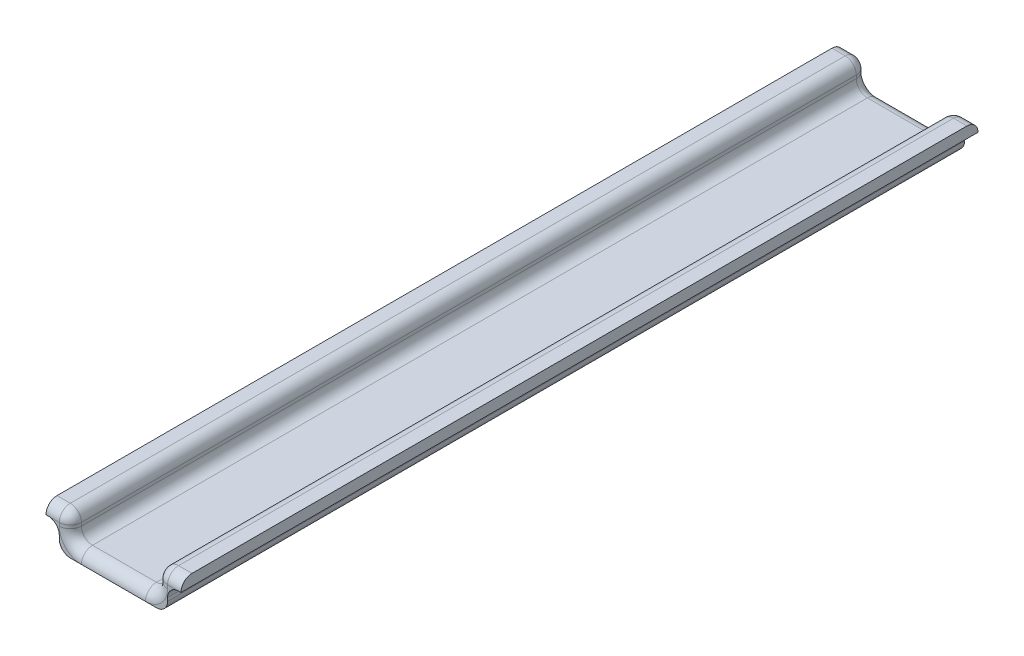
ISO-10303-21;
HEADER;
FILE_DESCRIPTION(('STEP AP214'),'2;1');
FILE_NAME('part.step','',(''),(''),'','','');
FILE_SCHEMA(('AUTOMOTIVE_DESIGN { 1 0 10303 214 1 1 1 1 }'));
ENDSEC;
DATA;
#1=APPLICATION_CONTEXT('core data for automotive mechanical design processes');
#2=APPLICATION_PROTOCOL_DEFINITION('international standard','automotive_design',2000,#1);
#3=PRODUCT_CONTEXT('',#1,'mechanical');
#4=PRODUCT('Part','Part','',(#3));
#5=PRODUCT_RELATED_PRODUCT_CATEGORY('part','',(#4));
#6=PRODUCT_DEFINITION_FORMATION('','',#4);
#7=PRODUCT_DEFINITION_CONTEXT('part definition',#1,'design');
#8=PRODUCT_DEFINITION('design','',#6,#7);
#9=PRODUCT_DEFINITION_SHAPE('','',#8);
#10=(LENGTH_UNIT() NAMED_UNIT(*) SI_UNIT(.MILLI.,.METRE.));
#11=(NAMED_UNIT(*) PLANE_ANGLE_UNIT() SI_UNIT($,.RADIAN.));
#12=(NAMED_UNIT(*) SI_UNIT($,.STERADIAN.) SOLID_ANGLE_UNIT());
#13=UNCERTAINTY_MEASURE_WITH_UNIT(LENGTH_MEASURE(1.E-05),#10,'distance_accuracy_value','');
#14=(GEOMETRIC_REPRESENTATION_CONTEXT(3) GLOBAL_UNCERTAINTY_ASSIGNED_CONTEXT((#13)) GLOBAL_UNIT_ASSIGNED_CONTEXT((#10,
#11,#12)) REPRESENTATION_CONTEXT('',''));
#15=CARTESIAN_POINT('',(0.,0.,0.));
#16=DIRECTION('',(0.,0.,1.));
#17=DIRECTION('',(1.,0.,0.));
#18=AXIS2_PLACEMENT_3D('',#15,#16,#17);
#19=CARTESIAN_POINT('',(-11.7684748149153,3.27703373913075,-2.54));
#20=DIRECTION('',(0.,0.,-1.));
#21=DIRECTION('',(-1.,0.,0.));
#22=AXIS2_PLACEMENT_3D('',#19,#20,#21);
#23=CYLINDRICAL_SURFACE('',#22,2.54);
#24=DIRECTION('',(0.,0.,1.));
#25=VECTOR('',#24,1.);
#26=CARTESIAN_POINT('',(-11.7684748149153,5.81703373913075,-2.54));
#27=LINE('',#26,#25);
#28=CARTESIAN_POINT('',(-11.7684748149153,5.81703373913075,-2.54));
#29=VERTEX_POINT('',#28);
#30=CARTESIAN_POINT('',(-11.7684748149153,5.81703373913075,180.34));
#31=VERTEX_POINT('',#30);
#32=EDGE_CURVE('E210',#29,#31,#27,.T.);
#33=ORIENTED_EDGE('',*,*,#32,.F.);
#34=CARTESIAN_POINT('',(-11.7684748149153,3.27703373913075,-2.54));
#35=DIRECTION('',(0.,0.,-1.));
#36=DIRECTION('',(-1.,0.,0.));
#37=AXIS2_PLACEMENT_3D('',#34,#35,#36);
#38=CIRCLE('',#37,2.54);
#39=CARTESIAN_POINT('',(-9.2284748149153,3.27703373913075,-2.54));
#40=VERTEX_POINT('',#39);
#41=EDGE_CURVE('E40',#29,#40,#38,.T.);
#42=ORIENTED_EDGE('',*,*,#41,.T.);
#43=DIRECTION('',(0.,0.,1.));
#44=VECTOR('',#43,1.);
#45=CARTESIAN_POINT('',(-9.2284748149153,3.27703373913075,-2.54));
#46=LINE('',#45,#44);
#47=CARTESIAN_POINT('',(-9.2284748149153,3.27703373913075,180.34));
#48=VERTEX_POINT('',#47);
#49=EDGE_CURVE('E406',#48,#40,#46,.F.);
#50=ORIENTED_EDGE('',*,*,#49,.F.);
#51=CARTESIAN_POINT('',(-11.7684748149153,3.27703373913075,180.34));
#52=DIRECTION('',(0.,0.,-1.));
#53=DIRECTION('',(-1.,0.,0.));
#54=AXIS2_PLACEMENT_3D('',#51,#52,#53);
#55=CIRCLE('',#54,2.54);
#56=EDGE_CURVE('E11',#48,#31,#55,.F.);
#57=ORIENTED_EDGE('',*,*,#56,.T.);
#58=EDGE_LOOP('',(#33,#42,#50,#57));
#59=FACE_BOUND('',#58,.T.);
#60=ADVANCED_FACE('F33',(#59),#23,.F.);
#61=CARTESIAN_POINT('',(-6.6884748149153,2.54,-2.54));
#62=DIRECTION('',(0.,0.,1.));
#63=DIRECTION('',(1.,0.,0.));
#64=AXIS2_PLACEMENT_3D('',#61,#62,#63);
#65=CYLINDRICAL_SURFACE('',#64,2.54);
#66=DIRECTION('',(0.,0.,1.));
#67=VECTOR('',#66,1.);
#68=CARTESIAN_POINT('',(-9.22847481491529,2.54,-2.54));
#69=LINE('',#68,#67);
#70=CARTESIAN_POINT('',(-9.22847481491529,2.54,-2.54));
#71=VERTEX_POINT('',#70);
#72=CARTESIAN_POINT('',(-9.22847481491529,2.54,180.34));
#73=VERTEX_POINT('',#72);
#74=EDGE_CURVE('E395',#71,#73,#69,.T.);
#75=ORIENTED_EDGE('',*,*,#74,.F.);
#76=CARTESIAN_POINT('',(-6.6884748149153,2.54,-2.54));
#77=DIRECTION('',(0.,0.,-1.));
#78=DIRECTION('',(-1.,0.,0.));
#79=AXIS2_PLACEMENT_3D('',#76,#77,#78);
#80=CIRCLE('',#79,2.54);
#81=CARTESIAN_POINT('',(-6.6884748149153,0.,-2.54));
#82=VERTEX_POINT('',#81);
#83=EDGE_CURVE('E401',#82,#71,#80,.T.);
#84=ORIENTED_EDGE('',*,*,#83,.F.);
#85=DIRECTION('',(0.,0.,1.));
#86=VECTOR('',#85,1.);
#87=CARTESIAN_POINT('',(-6.6884748149153,0.,-2.54));
#88=LINE('',#87,#86);
#89=CARTESIAN_POINT('',(-6.6884748149153,0.,180.34));
#90=VERTEX_POINT('',#89);
#91=EDGE_CURVE('E398',#90,#82,#88,.F.);
#92=ORIENTED_EDGE('',*,*,#91,.F.);
#93=CARTESIAN_POINT('',(-6.6884748149153,2.54,180.34));
#94=DIRECTION('',(0.,0.,-1.));
#95=DIRECTION('',(-1.,0.,0.));
#96=AXIS2_PLACEMENT_3D('',#93,#94,#95);
#97=CIRCLE('',#96,2.54);
#98=EDGE_CURVE('E403',#73,#90,#97,.F.);
#99=ORIENTED_EDGE('',*,*,#98,.F.);
#100=EDGE_LOOP('',(#75,#84,#92,#99));
#101=FACE_BOUND('',#100,.T.);
#102=ADVANCED_FACE('F499',(#101),#65,.T.);
#103=CARTESIAN_POINT('',(-9.2284748149153,5.81703373913075,177.8));
#104=DIRECTION('',(0.,0.,1.));
#105=DIRECTION('',(1.,0.,0.));
#106=AXIS2_PLACEMENT_3D('',#103,#104,#105);
#107=SPHERICAL_SURFACE('',#106,2.54);
#108=CARTESIAN_POINT('',(-9.2284748149153,5.81703373913075,177.8));
#109=DIRECTION('',(-1.,0.,0.));
#110=DIRECTION('',(0.,0.,1.));
#111=AXIS2_PLACEMENT_3D('',#108,#109,#110);
#112=CIRCLE('',#111,2.54);
#113=CARTESIAN_POINT('',(-9.2284748149153,5.81703373913075,180.34));
#114=VERTEX_POINT('',#113);
#115=CARTESIAN_POINT('',(-9.2284748149153,8.35703373913075,177.8));
#116=VERTEX_POINT('',#115);
#117=EDGE_CURVE('E393',#114,#116,#112,.T.);
#118=ORIENTED_EDGE('',*,*,#117,.F.);
#119=CARTESIAN_POINT('',(-9.2284748149153,5.81703373913075,177.8));
#120=DIRECTION('',(0.,-1.,0.));
#121=DIRECTION('',(1.,0.,0.));
#122=AXIS2_PLACEMENT_3D('',#119,#120,#121);
#123=CIRCLE('',#122,2.54);
#124=CARTESIAN_POINT('',(-6.6884748149153,5.81703373913075,177.8));
#125=VERTEX_POINT('',#124);
#126=EDGE_CURVE('E382',#125,#114,#123,.T.);
#127=ORIENTED_EDGE('',*,*,#126,.F.);
#128=CARTESIAN_POINT('',(-9.2284748149153,5.81703373913075,177.8));
#129=DIRECTION('',(0.,0.,1.));
#130=DIRECTION('',(1.,0.,0.));
#131=AXIS2_PLACEMENT_3D('',#128,#129,#130);
#132=CIRCLE('',#131,2.54);
#133=EDGE_CURVE('E390',#125,#116,#132,.T.);
#134=ORIENTED_EDGE('',*,*,#133,.T.);
#135=EDGE_LOOP('',(#118,#127,#134));
#136=FACE_BOUND('',#135,.T.);
#137=ADVANCED_FACE('F469',(#136),#107,.T.);
#138=CARTESIAN_POINT('',(-9.2284748149153,5.81703373913075,-2.54));
#139=DIRECTION('',(0.,0.,1.));
#140=DIRECTION('',(1.,0.,0.));
#141=AXIS2_PLACEMENT_3D('',#138,#139,#140);
#142=CYLINDRICAL_SURFACE('',#141,2.54);
#143=ORIENTED_EDGE('',*,*,#133,.F.);
#144=DIRECTION('',(0.,0.,1.));
#145=VECTOR('',#144,1.);
#146=CARTESIAN_POINT('',(-6.6884748149153,5.81703373913075,-2.54));
#147=LINE('',#146,#145);
#148=CARTESIAN_POINT('',(-6.6884748149153,5.81703373913075,0.));
#149=VERTEX_POINT('',#148);
#150=EDGE_CURVE('E379',#149,#125,#147,.T.);
#151=ORIENTED_EDGE('',*,*,#150,.F.);
#152=CARTESIAN_POINT('',(-9.2284748149153,5.81703373913075,0.));
#153=DIRECTION('',(0.,0.,1.));
#154=DIRECTION('',(1.,0.,0.));
#155=AXIS2_PLACEMENT_3D('',#152,#153,#154);
#156=CIRCLE('',#155,2.54);
#157=CARTESIAN_POINT('',(-9.2284748149153,8.35703373913075,0.));
#158=VERTEX_POINT('',#157);
#159=EDGE_CURVE('E388',#149,#158,#156,.T.);
#160=ORIENTED_EDGE('',*,*,#159,.T.);
#161=DIRECTION('',(0.,0.,1.));
#162=VECTOR('',#161,1.);
#163=CARTESIAN_POINT('',(-9.2284748149153,8.35703373913075,-2.54));
#164=LINE('',#163,#162);
#165=EDGE_CURVE('E370',#116,#158,#164,.F.);
#166=ORIENTED_EDGE('',*,*,#165,.F.);
#167=EDGE_LOOP('',(#143,#151,#160,#166));
#168=FACE_BOUND('',#167,.T.);
#169=ADVANCED_FACE('F472',(#168),#142,.T.);
#170=CARTESIAN_POINT('',(-9.2284748149153,5.81703373913075,0.));
#171=DIRECTION('',(0.,0.,1.));
#172=DIRECTION('',(1.,0.,0.));
#173=AXIS2_PLACEMENT_3D('',#170,#171,#172);
#174=SPHERICAL_SURFACE('',#173,2.54);
#175=ORIENTED_EDGE('',*,*,#159,.F.);
#176=CARTESIAN_POINT('',(-9.2284748149153,5.81703373913075,0.));
#177=DIRECTION('',(0.,1.,0.));
#178=DIRECTION('',(-1.,0.,0.));
#179=AXIS2_PLACEMENT_3D('',#176,#177,#178);
#180=CIRCLE('',#179,2.54);
#181=CARTESIAN_POINT('',(-9.2284748149153,5.81703373913075,-2.54));
#182=VERTEX_POINT('',#181);
#183=EDGE_CURVE('E376',#182,#149,#180,.F.);
#184=ORIENTED_EDGE('',*,*,#183,.F.);
#185=CARTESIAN_POINT('',(-9.2284748149153,5.81703373913075,0.));
#186=DIRECTION('',(1.,0.,0.));
#187=DIRECTION('',(0.,0.,-1.));
#188=AXIS2_PLACEMENT_3D('',#185,#186,#187);
#189=CIRCLE('',#188,2.54);
#190=EDGE_CURVE('E385',#182,#158,#189,.T.);
#191=ORIENTED_EDGE('',*,*,#190,.T.);
#192=EDGE_LOOP('',(#175,#184,#191));
#193=FACE_BOUND('',#192,.T.);
#194=ADVANCED_FACE('F548',(#193),#174,.T.);
#195=CARTESIAN_POINT('',(0.,5.81703373913075,0.));
#196=DIRECTION('',(1.,0.,0.));
#197=DIRECTION('',(0.,1.,0.));
#198=AXIS2_PLACEMENT_3D('',#195,#196,#197);
#199=CYLINDRICAL_SURFACE('',#198,2.54);
#200=ORIENTED_EDGE('',*,*,#190,.F.);
#201=DIRECTION('',(-1.,0.,0.));
#202=VECTOR('',#201,1.);
#203=CARTESIAN_POINT('',(-9.2284748149153,5.81703373913075,-2.54));
#204=LINE('',#203,#202);
#205=EDGE_CURVE('E426',#182,#29,#204,.T.);
#206=ORIENTED_EDGE('',*,*,#205,.T.);
#207=CARTESIAN_POINT('',(-12.2747305934921,5.81703373913075,-2.54));
#208=VERTEX_POINT('',#207);
#209=EDGE_CURVE('E451',#29,#208,#204,.T.);
#210=ORIENTED_EDGE('',*,*,#209,.T.);
#211=CARTESIAN_POINT('',(-12.2747305934921,5.81703373913075,0.));
#212=DIRECTION('',(1.,0.,0.));
#213=DIRECTION('',(0.,0.,-1.));
#214=AXIS2_PLACEMENT_3D('',#211,#212,#213);
#215=CIRCLE('',#214,2.54);
#216=CARTESIAN_POINT('',(-12.2747305934921,8.35703373913075,0.));
#217=VERTEX_POINT('',#216);
#218=EDGE_CURVE('E224',#217,#208,#215,.F.);
#219=ORIENTED_EDGE('',*,*,#218,.F.);
#220=DIRECTION('',(1.,0.,0.));
#221=VECTOR('',#220,1.);
#222=CARTESIAN_POINT('',(-9.2284748149153,8.35703373913075,0.));
#223=LINE('',#222,#221);
#224=EDGE_CURVE('E225',#158,#217,#223,.F.);
#225=ORIENTED_EDGE('',*,*,#224,.F.);
#226=EDGE_LOOP('',(#200,#206,#210,#219,#225));
#227=FACE_BOUND('',#226,.T.);
#228=ADVANCED_FACE('F477',(#227),#199,.T.);
#229=CARTESIAN_POINT('',(0.,5.81703373913075,177.8));
#230=DIRECTION('',(1.,0.,0.));
#231=DIRECTION('',(0.,1.,0.));
#232=AXIS2_PLACEMENT_3D('',#229,#230,#231);
#233=CYLINDRICAL_SURFACE('',#232,2.54);
#234=DIRECTION('',(-1.,0.,0.));
#235=VECTOR('',#234,1.);
#236=CARTESIAN_POINT('',(-9.2284748149153,5.81703373913075,180.34));
#237=LINE('',#236,#235);
#238=EDGE_CURVE('E213',#114,#31,#237,.T.);
#239=ORIENTED_EDGE('',*,*,#238,.F.);
#240=ORIENTED_EDGE('',*,*,#117,.T.);
#241=DIRECTION('',(-1.,0.,0.));
#242=VECTOR('',#241,1.);
#243=CARTESIAN_POINT('',(0.,8.35703373913075,177.8));
#244=LINE('',#243,#242);
#245=CARTESIAN_POINT('',(-12.2747305934921,8.35703373913075,177.8));
#246=VERTEX_POINT('',#245);
#247=EDGE_CURVE('E220',#246,#116,#244,.F.);
#248=ORIENTED_EDGE('',*,*,#247,.F.);
#249=CARTESIAN_POINT('',(-12.2747305934921,5.81703373913075,177.8));
#250=DIRECTION('',(1.,0.,0.));
#251=DIRECTION('',(0.,0.,-1.));
#252=AXIS2_PLACEMENT_3D('',#249,#250,#251);
#253=CIRCLE('',#252,2.54);
#254=CARTESIAN_POINT('',(-12.2747305934921,5.81703373913075,180.34));
#255=VERTEX_POINT('',#254);
#256=EDGE_CURVE('E217',#255,#246,#253,.F.);
#257=ORIENTED_EDGE('',*,*,#256,.F.);
#258=EDGE_CURVE('E204',#31,#255,#237,.T.);
#259=ORIENTED_EDGE('',*,*,#258,.F.);
#260=EDGE_LOOP('',(#239,#240,#248,#257,#259));
#261=FACE_BOUND('',#260,.T.);
#262=ADVANCED_FACE('F218',(#261),#233,.T.);
#263=CARTESIAN_POINT('',(13.079605827665,2.54,-2.54));
#264=DIRECTION('',(0.,0.,-1.));
#265=DIRECTION('',(-1.,0.,0.));
#266=AXIS2_PLACEMENT_3D('',#263,#264,#265);
#267=CYLINDRICAL_SURFACE('',#266,2.54);
#268=DIRECTION('',(0.,0.,-1.));
#269=VECTOR('',#268,1.);
#270=CARTESIAN_POINT('',(15.619605827665,2.54,-2.54));
#271=LINE('',#270,#269);
#272=CARTESIAN_POINT('',(15.619605827665,2.54,180.34));
#273=VERTEX_POINT('',#272);
#274=CARTESIAN_POINT('',(15.619605827665,2.54,-2.54));
#275=VERTEX_POINT('',#274);
#276=EDGE_CURVE('E359',#273,#275,#271,.T.);
#277=ORIENTED_EDGE('',*,*,#276,.F.);
#278=CARTESIAN_POINT('',(13.079605827665,2.54,180.34));
#279=DIRECTION('',(0.,0.,-1.));
#280=DIRECTION('',(-1.,0.,0.));
#281=AXIS2_PLACEMENT_3D('',#278,#279,#280);
#282=CIRCLE('',#281,2.54);
#283=CARTESIAN_POINT('',(13.079605827665,0.,180.34));
#284=VERTEX_POINT('',#283);
#285=EDGE_CURVE('E365',#284,#273,#282,.F.);
#286=ORIENTED_EDGE('',*,*,#285,.F.);
#287=DIRECTION('',(0.,0.,-1.));
#288=VECTOR('',#287,1.);
#289=CARTESIAN_POINT('',(13.079605827665,0.,-2.54));
#290=LINE('',#289,#288);
#291=CARTESIAN_POINT('',(13.079605827665,0.,-2.54));
#292=VERTEX_POINT('',#291);
#293=EDGE_CURVE('E362',#292,#284,#290,.F.);
#294=ORIENTED_EDGE('',*,*,#293,.F.);
#295=CARTESIAN_POINT('',(13.079605827665,2.54,-2.54));
#296=DIRECTION('',(0.,0.,-1.));
#297=DIRECTION('',(-1.,0.,0.));
#298=AXIS2_PLACEMENT_3D('',#295,#296,#297);
#299=CIRCLE('',#298,2.54);
#300=EDGE_CURVE('E367',#275,#292,#299,.T.);
#301=ORIENTED_EDGE('',*,*,#300,.F.);
#302=EDGE_LOOP('',(#277,#286,#294,#301));
#303=FACE_BOUND('',#302,.T.);
#304=ADVANCED_FACE('F544',(#303),#267,.T.);
#305=CARTESIAN_POINT('',(15.619605827665,5.84852827932123,177.8));
#306=DIRECTION('',(0.,0.,1.));
#307=DIRECTION('',(1.,0.,0.));
#308=AXIS2_PLACEMENT_3D('',#305,#306,#307);
#309=SPHERICAL_SURFACE('',#308,2.54);
#310=CARTESIAN_POINT('',(15.619605827665,5.84852827932123,177.8));
#311=DIRECTION('',(1.,0.,0.));
#312=DIRECTION('',(0.,0.,-1.));
#313=AXIS2_PLACEMENT_3D('',#310,#311,#312);
#314=CIRCLE('',#313,2.54);
#315=CARTESIAN_POINT('',(15.619605827665,8.38852827932123,177.8));
#316=VERTEX_POINT('',#315);
#317=CARTESIAN_POINT('',(15.619605827665,5.84852827932123,180.34));
#318=VERTEX_POINT('',#317);
#319=EDGE_CURVE('E357',#316,#318,#314,.T.);
#320=ORIENTED_EDGE('',*,*,#319,.F.);
#321=CARTESIAN_POINT('',(15.619605827665,5.84852827932123,177.8));
#322=DIRECTION('',(0.,0.,1.));
#323=DIRECTION('',(1.,0.,0.));
#324=AXIS2_PLACEMENT_3D('',#321,#322,#323);
#325=CIRCLE('',#324,2.54);
#326=CARTESIAN_POINT('',(13.079605827665,5.84852827932123,177.8));
#327=VERTEX_POINT('',#326);
#328=EDGE_CURVE('E355',#316,#327,#325,.T.);
#329=ORIENTED_EDGE('',*,*,#328,.T.);
#330=CARTESIAN_POINT('',(15.619605827665,5.84852827932123,177.8));
#331=DIRECTION('',(0.,1.,0.));
#332=DIRECTION('',(-1.,0.,0.));
#333=AXIS2_PLACEMENT_3D('',#330,#331,#332);
#334=CIRCLE('',#333,2.54);
#335=EDGE_CURVE('E345',#318,#327,#334,.F.);
#336=ORIENTED_EDGE('',*,*,#335,.F.);
#337=EDGE_LOOP('',(#320,#329,#336));
#338=FACE_BOUND('',#337,.T.);
#339=ADVANCED_FACE('F556',(#338),#309,.T.);
#340=CARTESIAN_POINT('',(15.619605827665,5.84852827932123,-2.54));
#341=DIRECTION('',(0.,0.,1.));
#342=DIRECTION('',(1.,0.,0.));
#343=AXIS2_PLACEMENT_3D('',#340,#341,#342);
#344=CYLINDRICAL_SURFACE('',#343,2.54);
#345=ORIENTED_EDGE('',*,*,#328,.F.);
#346=DIRECTION('',(0.,0.,1.));
#347=VECTOR('',#346,1.);
#348=CARTESIAN_POINT('',(15.619605827665,8.38852827932123,-2.54));
#349=LINE('',#348,#347);
#350=CARTESIAN_POINT('',(15.619605827665,8.38852827932123,0.));
#351=VERTEX_POINT('',#350);
#352=EDGE_CURVE('E327',#351,#316,#349,.T.);
#353=ORIENTED_EDGE('',*,*,#352,.F.);
#354=CARTESIAN_POINT('',(15.619605827665,5.84852827932123,0.));
#355=DIRECTION('',(0.,0.,1.));
#356=DIRECTION('',(1.,0.,0.));
#357=AXIS2_PLACEMENT_3D('',#354,#355,#356);
#358=CIRCLE('',#357,2.54);
#359=CARTESIAN_POINT('',(13.079605827665,5.84852827932123,0.));
#360=VERTEX_POINT('',#359);
#361=EDGE_CURVE('E353',#351,#360,#358,.T.);
#362=ORIENTED_EDGE('',*,*,#361,.T.);
#363=DIRECTION('',(0.,0.,1.));
#364=VECTOR('',#363,1.);
#365=CARTESIAN_POINT('',(13.079605827665,5.84852827932123,-2.54));
#366=LINE('',#365,#364);
#367=EDGE_CURVE('E342',#327,#360,#366,.F.);
#368=ORIENTED_EDGE('',*,*,#367,.F.);
#369=EDGE_LOOP('',(#345,#353,#362,#368));
#370=FACE_BOUND('',#369,.T.);
#371=ADVANCED_FACE('F564',(#370),#344,.T.);
#372=CARTESIAN_POINT('',(15.619605827665,5.84852827932123,0.));
#373=DIRECTION('',(0.,0.,1.));
#374=DIRECTION('',(1.,0.,0.));
#375=AXIS2_PLACEMENT_3D('',#372,#373,#374);
#376=SPHERICAL_SURFACE('',#375,2.54);
#377=ORIENTED_EDGE('',*,*,#361,.F.);
#378=CARTESIAN_POINT('',(15.619605827665,5.84852827932123,0.));
#379=DIRECTION('',(-1.,0.,0.));
#380=DIRECTION('',(0.,0.,1.));
#381=AXIS2_PLACEMENT_3D('',#378,#379,#380);
#382=CIRCLE('',#381,2.54);
#383=CARTESIAN_POINT('',(15.619605827665,5.84852827932123,-2.54));
#384=VERTEX_POINT('',#383);
#385=EDGE_CURVE('E351',#351,#384,#382,.T.);
#386=ORIENTED_EDGE('',*,*,#385,.T.);
#387=CARTESIAN_POINT('',(15.619605827665,5.84852827932123,0.));
#388=DIRECTION('',(0.,-1.,0.));
#389=DIRECTION('',(1.,0.,0.));
#390=AXIS2_PLACEMENT_3D('',#387,#388,#389);
#391=CIRCLE('',#390,2.54);
#392=EDGE_CURVE('E339',#360,#384,#391,.T.);
#393=ORIENTED_EDGE('',*,*,#392,.F.);
#394=EDGE_LOOP('',(#377,#386,#393));
#395=FACE_BOUND('',#394,.T.);
#396=ADVANCED_FACE('F568',(#395),#376,.T.);
#397=CARTESIAN_POINT('',(15.619605827665,5.84852827932123,0.));
#398=DIRECTION('',(-1.,0.,0.));
#399=DIRECTION('',(0.,-1.,0.));
#400=AXIS2_PLACEMENT_3D('',#397,#398,#399);
#401=CYLINDRICAL_SURFACE('',#400,2.54);
#402=ORIENTED_EDGE('',*,*,#385,.F.);
#403=DIRECTION('',(-1.,0.,0.));
#404=VECTOR('',#403,1.);
#405=CARTESIAN_POINT('',(15.619605827665,8.38852827932123,0.));
#406=LINE('',#405,#404);
#407=CARTESIAN_POINT('',(18.6948314249599,8.38852827932123,0.));
#408=VERTEX_POINT('',#407);
#409=EDGE_CURVE('E330',#408,#351,#406,.T.);
#410=ORIENTED_EDGE('',*,*,#409,.F.);
#411=CARTESIAN_POINT('',(18.6948314249599,5.84852827932123,0.));
#412=DIRECTION('',(-1.,0.,0.));
#413=DIRECTION('',(0.,0.,1.));
#414=AXIS2_PLACEMENT_3D('',#411,#412,#413);
#415=CIRCLE('',#414,2.54);
#416=CARTESIAN_POINT('',(18.6948314249599,5.84852827932123,-2.54));
#417=VERTEX_POINT('',#416);
#418=EDGE_CURVE('E337',#417,#408,#415,.F.);
#419=ORIENTED_EDGE('',*,*,#418,.F.);
#420=DIRECTION('',(-1.,0.,0.));
#421=VECTOR('',#420,1.);
#422=CARTESIAN_POINT('',(15.619605827665,5.84852827932123,-2.54));
#423=LINE('',#422,#421);
#424=CARTESIAN_POINT('',(18.159605827665,5.84852827932123,-2.54));
#425=VERTEX_POINT('',#424);
#426=EDGE_CURVE('E235',#417,#425,#423,.T.);
#427=ORIENTED_EDGE('',*,*,#426,.T.);
#428=DIRECTION('',(-1.,0.,0.));
#429=VECTOR('',#428,1.);
#430=CARTESIAN_POINT('',(0.,5.84852827932123,-2.54));
#431=LINE('',#430,#429);
#432=EDGE_CURVE('E333',#384,#425,#431,.F.);
#433=ORIENTED_EDGE('',*,*,#432,.F.);
#434=EDGE_LOOP('',(#402,#410,#419,#427,#433));
#435=FACE_BOUND('',#434,.T.);
#436=ADVANCED_FACE('F561',(#435),#401,.T.);
#437=CARTESIAN_POINT('',(15.619605827665,5.84852827932123,177.8));
#438=DIRECTION('',(-1.,0.,0.));
#439=DIRECTION('',(0.,-1.,0.));
#440=AXIS2_PLACEMENT_3D('',#437,#438,#439);
#441=CYLINDRICAL_SURFACE('',#440,2.54);
#442=DIRECTION('',(1.,0.,0.));
#443=VECTOR('',#442,1.);
#444=CARTESIAN_POINT('',(15.619605827665,8.38852827932123,177.8));
#445=LINE('',#444,#443);
#446=CARTESIAN_POINT('',(18.6948314249599,8.38852827932123,177.8));
#447=VERTEX_POINT('',#446);
#448=EDGE_CURVE('E324',#316,#447,#445,.T.);
#449=ORIENTED_EDGE('',*,*,#448,.F.);
#450=ORIENTED_EDGE('',*,*,#319,.T.);
#451=DIRECTION('',(1.,0.,0.));
#452=VECTOR('',#451,1.);
#453=CARTESIAN_POINT('',(15.619605827665,5.84852827932123,180.34));
#454=LINE('',#453,#452);
#455=CARTESIAN_POINT('',(18.159605827665,5.84852827932123,180.34));
#456=VERTEX_POINT('',#455);
#457=EDGE_CURVE('E348',#456,#318,#454,.F.);
#458=ORIENTED_EDGE('',*,*,#457,.F.);
#459=DIRECTION('',(-1.,0.,0.));
#460=VECTOR('',#459,1.);
#461=CARTESIAN_POINT('',(15.619605827665,5.84852827932123,180.34));
#462=LINE('',#461,#460);
#463=CARTESIAN_POINT('',(18.6948314249599,5.84852827932123,180.34));
#464=VERTEX_POINT('',#463);
#465=EDGE_CURVE('E448',#464,#456,#462,.T.);
#466=ORIENTED_EDGE('',*,*,#465,.F.);
#467=CARTESIAN_POINT('',(18.6948314249599,5.84852827932123,177.8));
#468=DIRECTION('',(-1.,0.,0.));
#469=DIRECTION('',(0.,0.,1.));
#470=AXIS2_PLACEMENT_3D('',#467,#468,#469);
#471=CIRCLE('',#470,2.54);
#472=EDGE_CURVE('E335',#447,#464,#471,.F.);
#473=ORIENTED_EDGE('',*,*,#472,.F.);
#474=EDGE_LOOP('',(#449,#450,#458,#466,#473));
#475=FACE_BOUND('',#474,.T.);
#476=ADVANCED_FACE('F445',(#475),#441,.T.);
#477=CARTESIAN_POINT('',(0.,0.,180.34));
#478=DIRECTION('',(0.,0.,-1.));
#479=DIRECTION('',(-1.,0.,0.));
#480=AXIS2_PLACEMENT_3D('',#477,#478,#479);
#481=PLANE('',#480);
#482=DIRECTION('',(-1.,0.,0.));
#483=VECTOR('',#482,1.);
#484=CARTESIAN_POINT('',(-9.22847481491529,0.,180.34));
#485=LINE('',#484,#483);
#486=CARTESIAN_POINT('',(10.539605827665,0.,180.34));
#487=VERTEX_POINT('',#486);
#488=EDGE_CURVE('E454',#284,#487,#485,.T.);
#489=ORIENTED_EDGE('',*,*,#488,.F.);
#490=ORIENTED_EDGE('',*,*,#285,.T.);
#491=DIRECTION('',(0.,-1.,0.));
#492=VECTOR('',#491,1.);
#493=CARTESIAN_POINT('',(15.619605827665,0.,180.34));
#494=LINE('',#493,#492);
#495=CARTESIAN_POINT('',(15.619605827665,3.30853018134257,180.34));
#496=VERTEX_POINT('',#495);
#497=EDGE_CURVE('E452',#496,#273,#494,.T.);
#498=ORIENTED_EDGE('',*,*,#497,.F.);
#499=CARTESIAN_POINT('',(18.159605827665,3.30852827932123,180.34));
#500=DIRECTION('',(0.,0.,-1.));
#501=DIRECTION('',(-1.,0.,0.));
#502=AXIS2_PLACEMENT_3D('',#499,#500,#501);
#503=CIRCLE('',#502,2.54);
#504=EDGE_CURVE('E319',#496,#456,#503,.T.);
#505=ORIENTED_EDGE('',*,*,#504,.T.);
#506=ORIENTED_EDGE('',*,*,#457,.T.);
#507=DIRECTION('',(0.,-1.,0.));
#508=VECTOR('',#507,1.);
#509=CARTESIAN_POINT('',(15.619605827665,2.54,180.34));
#510=LINE('',#509,#508);
#511=CARTESIAN_POINT('',(15.619605827665,5.08,180.34));
#512=VERTEX_POINT('',#511);
#513=EDGE_CURVE('E268',#318,#512,#510,.T.);
#514=ORIENTED_EDGE('',*,*,#513,.T.);
#515=CARTESIAN_POINT('',(10.539605827665,5.08,180.34));
#516=DIRECTION('',(0.,0.,-1.));
#517=DIRECTION('',(-1.,0.,0.));
#518=AXIS2_PLACEMENT_3D('',#515,#516,#517);
#519=CIRCLE('',#518,5.08);
#520=EDGE_CURVE('E265',#487,#512,#519,.F.);
#521=ORIENTED_EDGE('',*,*,#520,.F.);
#522=EDGE_LOOP('',(#489,#490,#498,#505,#506,#514,#521));
#523=FACE_BOUND('',#522,.T.);
#524=ADVANCED_FACE('F560',(#523),#481,.F.);
#525=DIRECTION('',(0.,1.,0.));
#526=VECTOR('',#525,1.);
#527=CARTESIAN_POINT('',(-9.22847481491529,0.,180.34));
#528=LINE('',#527,#526);
#529=EDGE_CURVE('E413',#73,#48,#528,.T.);
#530=ORIENTED_EDGE('',*,*,#529,.F.);
#531=ORIENTED_EDGE('',*,*,#98,.T.);
#532=CARTESIAN_POINT('',(-4.1484748149153,0.,180.34));
#533=VERTEX_POINT('',#532);
#534=EDGE_CURVE('E459',#533,#90,#485,.T.);
#535=ORIENTED_EDGE('',*,*,#534,.F.);
#536=CARTESIAN_POINT('',(-4.1484748149153,5.08,180.34));
#537=DIRECTION('',(0.,0.,-1.));
#538=DIRECTION('',(-1.,0.,0.));
#539=AXIS2_PLACEMENT_3D('',#536,#537,#538);
#540=CIRCLE('',#539,5.08);
#541=CARTESIAN_POINT('',(-9.2284748149153,5.08,180.34));
#542=VERTEX_POINT('',#541);
#543=EDGE_CURVE('E262',#542,#533,#540,.F.);
#544=ORIENTED_EDGE('',*,*,#543,.F.);
#545=EDGE_CURVE('E460',#542,#114,#528,.T.);
#546=ORIENTED_EDGE('',*,*,#545,.T.);
#547=ORIENTED_EDGE('',*,*,#238,.T.);
#548=ORIENTED_EDGE('',*,*,#56,.F.);
#549=EDGE_LOOP('',(#530,#531,#535,#544,#546,#547,#548));
#550=FACE_BOUND('',#549,.T.);
#551=ADVANCED_FACE('F463',(#550),#481,.F.);
#552=CARTESIAN_POINT('',(0.,0.,-2.54));
#553=DIRECTION('',(0.,0.,-1.));
#554=DIRECTION('',(-1.,0.,0.));
#555=AXIS2_PLACEMENT_3D('',#552,#553,#554);
#556=PLANE('',#555);
#557=DIRECTION('',(0.,-1.,0.));
#558=VECTOR('',#557,1.);
#559=CARTESIAN_POINT('',(15.619605827665,0.,-2.54));
#560=LINE('',#559,#558);
#561=CARTESIAN_POINT('',(15.619605827665,3.30852827932123,-2.54));
#562=VERTEX_POINT('',#561);
#563=EDGE_CURVE('E430',#562,#275,#560,.T.);
#564=ORIENTED_EDGE('',*,*,#563,.T.);
#565=ORIENTED_EDGE('',*,*,#300,.T.);
#566=DIRECTION('',(-1.,0.,0.));
#567=VECTOR('',#566,1.);
#568=CARTESIAN_POINT('',(-9.22847481491529,0.,-2.54));
#569=LINE('',#568,#567);
#570=CARTESIAN_POINT('',(10.539605827665,0.,-2.54));
#571=VERTEX_POINT('',#570);
#572=EDGE_CURVE('E424',#292,#571,#569,.T.);
#573=ORIENTED_EDGE('',*,*,#572,.T.);
#574=CARTESIAN_POINT('',(10.539605827665,5.08,-2.54));
#575=DIRECTION('',(0.,0.,-1.));
#576=DIRECTION('',(-1.,0.,0.));
#577=AXIS2_PLACEMENT_3D('',#574,#575,#576);
#578=CIRCLE('',#577,5.08);
#579=CARTESIAN_POINT('',(15.619605827665,5.08,-2.54));
#580=VERTEX_POINT('',#579);
#581=EDGE_CURVE('E246',#580,#571,#578,.T.);
#582=ORIENTED_EDGE('',*,*,#581,.F.);
#583=DIRECTION('',(0.,-1.,0.));
#584=VECTOR('',#583,1.);
#585=CARTESIAN_POINT('',(15.619605827665,0.,-2.54));
#586=LINE('',#585,#584);
#587=EDGE_CURVE('E252',#580,#384,#586,.F.);
#588=ORIENTED_EDGE('',*,*,#587,.T.);
#589=ORIENTED_EDGE('',*,*,#432,.T.);
#590=CARTESIAN_POINT('',(18.159605827665,3.30852827932123,-2.54));
#591=DIRECTION('',(0.,0.,-1.));
#592=DIRECTION('',(-1.,0.,0.));
#593=AXIS2_PLACEMENT_3D('',#590,#591,#592);
#594=CIRCLE('',#593,2.54);
#595=EDGE_CURVE('E322',#425,#562,#594,.F.);
#596=ORIENTED_EDGE('',*,*,#595,.T.);
#597=EDGE_LOOP('',(#564,#565,#573,#582,#588,#589,#596));
#598=FACE_BOUND('',#597,.T.);
#599=ADVANCED_FACE('F589',(#598),#556,.T.);
#600=CARTESIAN_POINT('',(-4.1484748149153,0.,-2.54));
#601=VERTEX_POINT('',#600);
#602=EDGE_CURVE('E419',#601,#82,#569,.T.);
#603=ORIENTED_EDGE('',*,*,#602,.T.);
#604=ORIENTED_EDGE('',*,*,#83,.T.);
#605=DIRECTION('',(0.,1.,0.));
#606=VECTOR('',#605,1.);
#607=CARTESIAN_POINT('',(-9.22847481491529,0.,-2.54));
#608=LINE('',#607,#606);
#609=EDGE_CURVE('E412',#71,#40,#608,.T.);
#610=ORIENTED_EDGE('',*,*,#609,.T.);
#611=ORIENTED_EDGE('',*,*,#41,.F.);
#612=ORIENTED_EDGE('',*,*,#205,.F.);
#613=CARTESIAN_POINT('',(-9.2284748149153,5.08,-2.54));
#614=VERTEX_POINT('',#613);
#615=EDGE_CURVE('E420',#614,#182,#608,.T.);
#616=ORIENTED_EDGE('',*,*,#615,.F.);
#617=CARTESIAN_POINT('',(-4.1484748149153,5.08,-2.54));
#618=DIRECTION('',(0.,0.,-1.));
#619=DIRECTION('',(-1.,0.,0.));
#620=AXIS2_PLACEMENT_3D('',#617,#618,#619);
#621=CIRCLE('',#620,5.08);
#622=EDGE_CURVE('E249',#601,#614,#621,.T.);
#623=ORIENTED_EDGE('',*,*,#622,.F.);
#624=EDGE_LOOP('',(#603,#604,#610,#611,#612,#616,#623));
#625=FACE_BOUND('',#624,.T.);
#626=ADVANCED_FACE('F416',(#625),#556,.T.);
#627=CARTESIAN_POINT('',(-9.2284748149153,8.35703373913075,-2.54));
#628=DIRECTION('',(0.,1.,0.));
#629=DIRECTION('',(-1.,0.,0.));
#630=AXIS2_PLACEMENT_3D('',#627,#628,#629);
#631=PLANE('',#630);
#632=ORIENTED_EDGE('',*,*,#165,.T.);
#633=ORIENTED_EDGE('',*,*,#224,.T.);
#634=DIRECTION('',(0.,0.,1.));
#635=VECTOR('',#634,1.);
#636=CARTESIAN_POINT('',(-12.2747305934921,8.35703373913075,-2.54));
#637=LINE('',#636,#635);
#638=EDGE_CURVE('E230',#217,#246,#637,.T.);
#639=ORIENTED_EDGE('',*,*,#638,.T.);
#640=ORIENTED_EDGE('',*,*,#247,.T.);
#641=EDGE_LOOP('',(#632,#633,#639,#640));
#642=FACE_BOUND('',#641,.T.);
#643=ADVANCED_FACE('F474',(#642),#631,.T.);
#644=CARTESIAN_POINT('',(-6.68847481491529,0.,-2.54));
#645=DIRECTION('',(1.,0.,0.));
#646=DIRECTION('',(0.,1.,0.));
#647=AXIS2_PLACEMENT_3D('',#644,#645,#646);
#648=PLANE('',#647);
#649=DIRECTION('',(0.,1.,0.));
#650=VECTOR('',#649,1.);
#651=CARTESIAN_POINT('',(-6.68847481491529,0.,0.));
#652=LINE('',#651,#650);
#653=CARTESIAN_POINT('',(-6.6884748149153,5.08,0.));
#654=VERTEX_POINT('',#653);
#655=EDGE_CURVE('E259',#654,#149,#652,.T.);
#656=ORIENTED_EDGE('',*,*,#655,.T.);
#657=ORIENTED_EDGE('',*,*,#150,.T.);
#658=DIRECTION('',(0.,1.,0.));
#659=VECTOR('',#658,1.);
#660=CARTESIAN_POINT('',(-6.6884748149153,2.54,177.8));
#661=LINE('',#660,#659);
#662=CARTESIAN_POINT('',(-6.6884748149153,5.08,177.8));
#663=VERTEX_POINT('',#662);
#664=EDGE_CURVE('E257',#125,#663,#661,.F.);
#665=ORIENTED_EDGE('',*,*,#664,.T.);
#666=DIRECTION('',(0.,0.,1.));
#667=VECTOR('',#666,1.);
#668=CARTESIAN_POINT('',(-6.6884748149153,5.08,-2.54));
#669=LINE('',#668,#667);
#670=EDGE_CURVE('E255',#663,#654,#669,.F.);
#671=ORIENTED_EDGE('',*,*,#670,.T.);
#672=EDGE_LOOP('',(#656,#657,#665,#671));
#673=FACE_BOUND('',#672,.T.);
#674=ADVANCED_FACE('F521',(#673),#648,.T.);
#675=CARTESIAN_POINT('',(-9.22847481491529,2.54,-2.54));
#676=DIRECTION('',(0.,1.,0.));
#677=DIRECTION('',(0.,0.,1.));
#678=AXIS2_PLACEMENT_3D('',#675,#676,#677);
#679=PLANE('',#678);
#680=DIRECTION('',(0.,0.,1.));
#681=VECTOR('',#680,1.);
#682=CARTESIAN_POINT('',(10.539605827665,2.54,-2.54));
#683=LINE('',#682,#681);
#684=CARTESIAN_POINT('',(10.539605827665,2.54,177.8));
#685=VERTEX_POINT('',#684);
#686=CARTESIAN_POINT('',(10.539605827665,2.54,0.));
#687=VERTEX_POINT('',#686);
#688=EDGE_CURVE('E274',#685,#687,#683,.F.);
#689=ORIENTED_EDGE('',*,*,#688,.T.);
#690=DIRECTION('',(-1.,0.,0.));
#691=VECTOR('',#690,1.);
#692=CARTESIAN_POINT('',(-9.22847481491529,2.54,0.));
#693=LINE('',#692,#691);
#694=CARTESIAN_POINT('',(-4.1484748149153,2.54,0.));
#695=VERTEX_POINT('',#694);
#696=EDGE_CURVE('E276',#687,#695,#693,.T.);
#697=ORIENTED_EDGE('',*,*,#696,.T.);
#698=DIRECTION('',(0.,0.,1.));
#699=VECTOR('',#698,1.);
#700=CARTESIAN_POINT('',(-4.1484748149153,2.54,180.34));
#701=LINE('',#700,#699);
#702=CARTESIAN_POINT('',(-4.1484748149153,2.54,177.8));
#703=VERTEX_POINT('',#702);
#704=EDGE_CURVE('E270',#695,#703,#701,.T.);
#705=ORIENTED_EDGE('',*,*,#704,.T.);
#706=DIRECTION('',(-1.,0.,0.));
#707=VECTOR('',#706,1.);
#708=CARTESIAN_POINT('',(13.079605827665,2.54,177.8));
#709=LINE('',#708,#707);
#710=EDGE_CURVE('E272',#703,#685,#709,.F.);
#711=ORIENTED_EDGE('',*,*,#710,.T.);
#712=EDGE_LOOP('',(#689,#697,#705,#711));
#713=FACE_BOUND('',#712,.T.);
#714=ADVANCED_FACE('F513',(#713),#679,.T.);
#715=CARTESIAN_POINT('',(13.079605827665,0.,-2.54));
#716=DIRECTION('',(-1.,0.,0.));
#717=DIRECTION('',(0.,-1.,0.));
#718=AXIS2_PLACEMENT_3D('',#715,#716,#717);
#719=PLANE('',#718);
#720=DIRECTION('',(0.,-1.,0.));
#721=VECTOR('',#720,1.);
#722=CARTESIAN_POINT('',(13.079605827665,8.38852827932123,177.8));
#723=LINE('',#722,#721);
#724=CARTESIAN_POINT('',(13.079605827665,5.08,177.8));
#725=VERTEX_POINT('',#724);
#726=EDGE_CURVE('E241',#725,#327,#723,.F.);
#727=ORIENTED_EDGE('',*,*,#726,.T.);
#728=ORIENTED_EDGE('',*,*,#367,.T.);
#729=DIRECTION('',(0.,-1.,0.));
#730=VECTOR('',#729,1.);
#731=CARTESIAN_POINT('',(13.079605827665,0.,0.));
#732=LINE('',#731,#730);
#733=CARTESIAN_POINT('',(13.079605827665,5.08,0.));
#734=VERTEX_POINT('',#733);
#735=EDGE_CURVE('E244',#360,#734,#732,.T.);
#736=ORIENTED_EDGE('',*,*,#735,.T.);
#737=DIRECTION('',(0.,0.,1.));
#738=VECTOR('',#737,1.);
#739=CARTESIAN_POINT('',(13.079605827665,5.08,180.34));
#740=LINE('',#739,#738);
#741=EDGE_CURVE('E239',#734,#725,#740,.T.);
#742=ORIENTED_EDGE('',*,*,#741,.T.);
#743=EDGE_LOOP('',(#727,#728,#736,#742));
#744=FACE_BOUND('',#743,.T.);
#745=ADVANCED_FACE('F637',(#744),#719,.T.);
#746=CARTESIAN_POINT('',(15.619605827665,8.38852827932123,-2.54));
#747=DIRECTION('',(0.,1.,0.));
#748=DIRECTION('',(-1.,0.,0.));
#749=AXIS2_PLACEMENT_3D('',#746,#747,#748);
#750=PLANE('',#749);
#751=DIRECTION('',(0.,0.,1.));
#752=VECTOR('',#751,1.);
#753=CARTESIAN_POINT('',(18.6948314249599,8.38852827932123,-2.54));
#754=LINE('',#753,#752);
#755=EDGE_CURVE('E233',#408,#447,#754,.T.);
#756=ORIENTED_EDGE('',*,*,#755,.F.);
#757=ORIENTED_EDGE('',*,*,#409,.T.);
#758=ORIENTED_EDGE('',*,*,#352,.T.);
#759=ORIENTED_EDGE('',*,*,#448,.T.);
#760=EDGE_LOOP('',(#756,#757,#758,#759));
#761=FACE_BOUND('',#760,.T.);
#762=ADVANCED_FACE('F441',(#761),#750,.T.);
#763=CARTESIAN_POINT('',(18.6948314249599,8.38852827932123,-2.54));
#764=DIRECTION('',(-1.,0.,0.));
#765=DIRECTION('',(0.,0.,1.));
#766=AXIS2_PLACEMENT_3D('',#763,#764,#765);
#767=PLANE('',#766);
#768=DIRECTION('',(0.,0.,1.));
#769=VECTOR('',#768,1.);
#770=CARTESIAN_POINT('',(18.6948314249599,5.84852827932123,-2.54));
#771=LINE('',#770,#769);
#772=EDGE_CURVE('E229',#417,#464,#771,.T.);
#773=ORIENTED_EDGE('',*,*,#772,.F.);
#774=ORIENTED_EDGE('',*,*,#418,.T.);
#775=ORIENTED_EDGE('',*,*,#755,.T.);
#776=ORIENTED_EDGE('',*,*,#472,.T.);
#777=EDGE_LOOP('',(#773,#774,#775,#776));
#778=FACE_BOUND('',#777,.T.);
#779=ADVANCED_FACE('F438',(#778),#767,.F.);
#780=CARTESIAN_POINT('',(15.619605827665,5.84852827932123,-2.54));
#781=DIRECTION('',(0.,1.,0.));
#782=DIRECTION('',(-1.,0.,0.));
#783=AXIS2_PLACEMENT_3D('',#780,#781,#782);
#784=PLANE('',#783);
#785=ORIENTED_EDGE('',*,*,#465,.T.);
#786=DIRECTION('',(0.,0.,1.));
#787=VECTOR('',#786,1.);
#788=CARTESIAN_POINT('',(18.159605827665,5.84852827932123,-2.54));
#789=LINE('',#788,#787);
#790=EDGE_CURVE('E316',#456,#425,#789,.F.);
#791=ORIENTED_EDGE('',*,*,#790,.T.);
#792=ORIENTED_EDGE('',*,*,#426,.F.);
#793=ORIENTED_EDGE('',*,*,#772,.T.);
#794=EDGE_LOOP('',(#785,#791,#792,#793));
#795=FACE_BOUND('',#794,.T.);
#796=ADVANCED_FACE('F642',(#795),#784,.F.);
#797=CARTESIAN_POINT('',(15.619605827665,0.,-2.54));
#798=DIRECTION('',(-1.,0.,0.));
#799=DIRECTION('',(0.,-1.,0.));
#800=AXIS2_PLACEMENT_3D('',#797,#798,#799);
#801=PLANE('',#800);
#802=ORIENTED_EDGE('',*,*,#497,.T.);
#803=ORIENTED_EDGE('',*,*,#276,.T.);
#804=ORIENTED_EDGE('',*,*,#563,.F.);
#805=DIRECTION('',(0.,0.,1.));
#806=VECTOR('',#805,1.);
#807=CARTESIAN_POINT('',(15.619605827665,3.30852827932123,180.34));
#808=LINE('',#807,#806);
#809=EDGE_CURVE('E279',#562,#496,#808,.T.);
#810=ORIENTED_EDGE('',*,*,#809,.T.);
#811=EDGE_LOOP('',(#802,#803,#804,#810));
#812=FACE_BOUND('',#811,.T.);
#813=ADVANCED_FACE('F592',(#812),#801,.F.);
#814=CARTESIAN_POINT('',(-9.22847481491529,0.,-2.54));
#815=DIRECTION('',(0.,1.,0.));
#816=DIRECTION('',(0.,0.,1.));
#817=AXIS2_PLACEMENT_3D('',#814,#815,#816);
#818=PLANE('',#817);
#819=ORIENTED_EDGE('',*,*,#534,.T.);
#820=ORIENTED_EDGE('',*,*,#91,.T.);
#821=ORIENTED_EDGE('',*,*,#602,.F.);
#822=EDGE_CURVE('E422',#571,#601,#569,.T.);
#823=ORIENTED_EDGE('',*,*,#822,.F.);
#824=ORIENTED_EDGE('',*,*,#572,.F.);
#825=ORIENTED_EDGE('',*,*,#293,.T.);
#826=ORIENTED_EDGE('',*,*,#488,.T.);
#827=EDGE_CURVE('E458',#487,#533,#485,.T.);
#828=ORIENTED_EDGE('',*,*,#827,.T.);
#829=EDGE_LOOP('',(#819,#820,#821,#823,#824,#825,#826,#828));
#830=FACE_BOUND('',#829,.T.);
#831=ADVANCED_FACE('F493',(#830),#818,.F.);
#832=CARTESIAN_POINT('',(-9.22847481491529,0.,-2.54));
#833=DIRECTION('',(1.,0.,0.));
#834=DIRECTION('',(0.,1.,0.));
#835=AXIS2_PLACEMENT_3D('',#832,#833,#834);
#836=PLANE('',#835);
#837=ORIENTED_EDGE('',*,*,#529,.T.);
#838=ORIENTED_EDGE('',*,*,#49,.T.);
#839=ORIENTED_EDGE('',*,*,#609,.F.);
#840=ORIENTED_EDGE('',*,*,#74,.T.);
#841=EDGE_LOOP('',(#837,#838,#839,#840));
#842=FACE_BOUND('',#841,.T.);
#843=ADVANCED_FACE('F411',(#842),#836,.F.);
#844=CARTESIAN_POINT('',(-9.2284748149153,5.81703373913075,-2.54));
#845=DIRECTION('',(0.,1.,0.));
#846=DIRECTION('',(-1.,0.,0.));
#847=AXIS2_PLACEMENT_3D('',#844,#845,#846);
#848=PLANE('',#847);
#849=ORIENTED_EDGE('',*,*,#209,.F.);
#850=ORIENTED_EDGE('',*,*,#32,.T.);
#851=ORIENTED_EDGE('',*,*,#258,.T.);
#852=DIRECTION('',(0.,0.,1.));
#853=VECTOR('',#852,1.);
#854=CARTESIAN_POINT('',(-12.2747305934921,5.81703373913075,-2.54));
#855=LINE('',#854,#853);
#856=EDGE_CURVE('E209',#208,#255,#855,.T.);
#857=ORIENTED_EDGE('',*,*,#856,.F.);
#858=EDGE_LOOP('',(#849,#850,#851,#857));
#859=FACE_BOUND('',#858,.T.);
#860=ADVANCED_FACE('F207',(#859),#848,.F.);
#861=CARTESIAN_POINT('',(-12.2747305934921,5.81703373913075,-2.54));
#862=DIRECTION('',(1.,0.,0.));
#863=DIRECTION('',(0.,0.,-1.));
#864=AXIS2_PLACEMENT_3D('',#861,#862,#863);
#865=PLANE('',#864);
#866=ORIENTED_EDGE('',*,*,#638,.F.);
#867=ORIENTED_EDGE('',*,*,#218,.T.);
#868=ORIENTED_EDGE('',*,*,#856,.T.);
#869=ORIENTED_EDGE('',*,*,#256,.T.);
#870=EDGE_LOOP('',(#866,#867,#868,#869));
#871=FACE_BOUND('',#870,.T.);
#872=ADVANCED_FACE('F228',(#871),#865,.F.);
#873=CARTESIAN_POINT('',(-9.22847481491529,0.,177.8));
#874=DIRECTION('',(0.,-1.,0.));
#875=DIRECTION('',(1.,0.,0.));
#876=AXIS2_PLACEMENT_3D('',#873,#874,#875);
#877=CYLINDRICAL_SURFACE('',#876,2.54);
#878=ORIENTED_EDGE('',*,*,#664,.F.);
#879=ORIENTED_EDGE('',*,*,#126,.T.);
#880=ORIENTED_EDGE('',*,*,#545,.F.);
#881=CARTESIAN_POINT('',(-9.2284748149153,5.08,177.8));
#882=DIRECTION('',(0.,-1.,0.));
#883=DIRECTION('',(1.,0.,0.));
#884=AXIS2_PLACEMENT_3D('',#881,#882,#883);
#885=CIRCLE('',#884,2.54);
#886=EDGE_CURVE('E214',#663,#542,#885,.T.);
#887=ORIENTED_EDGE('',*,*,#886,.F.);
#888=EDGE_LOOP('',(#878,#879,#880,#887));
#889=FACE_BOUND('',#888,.T.);
#890=ADVANCED_FACE('F523',(#889),#877,.T.);
#891=CARTESIAN_POINT('',(-4.1484748149153,5.08,177.8));
#892=DIRECTION('',(0.,0.,-1.));
#893=DIRECTION('',(-1.,0.,0.));
#894=AXIS2_PLACEMENT_3D('',#891,#892,#893);
#895=TOROIDAL_SURFACE('',#894,5.08,2.54);
#896=ORIENTED_EDGE('',*,*,#886,.T.);
#897=ORIENTED_EDGE('',*,*,#543,.T.);
#898=CARTESIAN_POINT('',(-4.1484748149153,0.,177.8));
#899=DIRECTION('',(-1.,0.,0.));
#900=DIRECTION('',(0.,0.,1.));
#901=AXIS2_PLACEMENT_3D('',#898,#899,#900);
#902=CIRCLE('',#901,2.54);
#903=EDGE_CURVE('E309',#703,#533,#902,.F.);
#904=ORIENTED_EDGE('',*,*,#903,.F.);
#905=CARTESIAN_POINT('',(-4.1484748149153,5.08,177.8));
#906=DIRECTION('',(0.,0.,-1.));
#907=DIRECTION('',(-1.,0.,0.));
#908=AXIS2_PLACEMENT_3D('',#905,#906,#907);
#909=CIRCLE('',#908,2.54);
#910=EDGE_CURVE('E306',#663,#703,#909,.F.);
#911=ORIENTED_EDGE('',*,*,#910,.F.);
#912=EDGE_LOOP('',(#896,#897,#904,#911));
#913=FACE_BOUND('',#912,.T.);
#914=ADVANCED_FACE('F507',(#913),#895,.T.);
#915=CARTESIAN_POINT('',(15.619605827665,0.,177.8));
#916=DIRECTION('',(0.,1.,0.));
#917=DIRECTION('',(-1.,0.,0.));
#918=AXIS2_PLACEMENT_3D('',#915,#916,#917);
#919=CYLINDRICAL_SURFACE('',#918,2.54);
#920=ORIENTED_EDGE('',*,*,#513,.F.);
#921=ORIENTED_EDGE('',*,*,#335,.T.);
#922=ORIENTED_EDGE('',*,*,#726,.F.);
#923=CARTESIAN_POINT('',(15.619605827665,5.08,177.8));
#924=DIRECTION('',(0.,-1.,0.));
#925=DIRECTION('',(1.,0.,0.));
#926=AXIS2_PLACEMENT_3D('',#923,#924,#925);
#927=CIRCLE('',#926,2.54);
#928=EDGE_CURVE('E303',#512,#725,#927,.T.);
#929=ORIENTED_EDGE('',*,*,#928,.F.);
#930=EDGE_LOOP('',(#920,#921,#922,#929));
#931=FACE_BOUND('',#930,.T.);
#932=ADVANCED_FACE('F530',(#931),#919,.T.);
#933=CARTESIAN_POINT('',(0.,0.,177.8));
#934=DIRECTION('',(1.,0.,0.));
#935=DIRECTION('',(0.,0.,-1.));
#936=AXIS2_PLACEMENT_3D('',#933,#934,#935);
#937=CYLINDRICAL_SURFACE('',#936,2.54);
#938=ORIENTED_EDGE('',*,*,#903,.T.);
#939=ORIENTED_EDGE('',*,*,#827,.F.);
#940=CARTESIAN_POINT('',(10.539605827665,0.,177.8));
#941=DIRECTION('',(1.,0.,0.));
#942=DIRECTION('',(0.,0.,-1.));
#943=AXIS2_PLACEMENT_3D('',#940,#941,#942);
#944=CIRCLE('',#943,2.54);
#945=EDGE_CURVE('E300',#685,#487,#944,.T.);
#946=ORIENTED_EDGE('',*,*,#945,.F.);
#947=ORIENTED_EDGE('',*,*,#710,.F.);
#948=EDGE_LOOP('',(#938,#939,#946,#947));
#949=FACE_BOUND('',#948,.T.);
#950=ADVANCED_FACE('F510',(#949),#937,.T.);
#951=CARTESIAN_POINT('',(-4.1484748149153,5.08,-2.54));
#952=DIRECTION('',(0.,0.,-1.));
#953=DIRECTION('',(-1.,0.,0.));
#954=AXIS2_PLACEMENT_3D('',#951,#952,#953);
#955=CYLINDRICAL_SURFACE('',#954,2.54);
#956=ORIENTED_EDGE('',*,*,#910,.T.);
#957=ORIENTED_EDGE('',*,*,#704,.F.);
#958=CARTESIAN_POINT('',(-4.1484748149153,5.08,0.));
#959=DIRECTION('',(0.,0.,-1.));
#960=DIRECTION('',(-1.,0.,0.));
#961=AXIS2_PLACEMENT_3D('',#958,#959,#960);
#962=CIRCLE('',#961,2.54);
#963=EDGE_CURVE('E297',#654,#695,#962,.F.);
#964=ORIENTED_EDGE('',*,*,#963,.F.);
#965=ORIENTED_EDGE('',*,*,#670,.F.);
#966=EDGE_LOOP('',(#956,#957,#964,#965));
#967=FACE_BOUND('',#966,.T.);
#968=ADVANCED_FACE('F519',(#967),#955,.F.);
#969=CARTESIAN_POINT('',(-9.22847481491529,0.,0.));
#970=DIRECTION('',(0.,1.,0.));
#971=DIRECTION('',(-1.,0.,0.));
#972=AXIS2_PLACEMENT_3D('',#969,#970,#971);
#973=CYLINDRICAL_SURFACE('',#972,2.54);
#974=ORIENTED_EDGE('',*,*,#615,.T.);
#975=ORIENTED_EDGE('',*,*,#183,.T.);
#976=ORIENTED_EDGE('',*,*,#655,.F.);
#977=CARTESIAN_POINT('',(-9.22847481491529,5.08,0.));
#978=DIRECTION('',(0.,-1.,0.));
#979=DIRECTION('',(1.,0.,0.));
#980=AXIS2_PLACEMENT_3D('',#977,#978,#979);
#981=CIRCLE('',#980,2.54);
#982=EDGE_CURVE('E294',#614,#654,#981,.T.);
#983=ORIENTED_EDGE('',*,*,#982,.F.);
#984=EDGE_LOOP('',(#974,#975,#976,#983));
#985=FACE_BOUND('',#984,.T.);
#986=ADVANCED_FACE('F482',(#985),#973,.T.);
#987=CARTESIAN_POINT('',(10.539605827665,5.08,177.8));
#988=DIRECTION('',(0.,0.,-1.));
#989=DIRECTION('',(-1.,0.,0.));
#990=AXIS2_PLACEMENT_3D('',#987,#988,#989);
#991=TOROIDAL_SURFACE('',#990,5.08,2.54);
#992=ORIENTED_EDGE('',*,*,#520,.T.);
#993=ORIENTED_EDGE('',*,*,#928,.T.);
#994=CARTESIAN_POINT('',(10.539605827665,5.08,177.8));
#995=DIRECTION('',(0.,0.,-1.));
#996=DIRECTION('',(-1.,0.,0.));
#997=AXIS2_PLACEMENT_3D('',#994,#995,#996);
#998=CIRCLE('',#997,2.54);
#999=EDGE_CURVE('E291',#685,#725,#998,.F.);
#1000=ORIENTED_EDGE('',*,*,#999,.F.);
#1001=ORIENTED_EDGE('',*,*,#945,.T.);
#1002=EDGE_LOOP('',(#992,#993,#1000,#1001));
#1003=FACE_BOUND('',#1002,.T.);
#1004=ADVANCED_FACE('F602',(#1003),#991,.T.);
#1005=CARTESIAN_POINT('',(-4.1484748149153,5.08,0.));
#1006=DIRECTION('',(0.,0.,-1.));
#1007=DIRECTION('',(-1.,0.,0.));
#1008=AXIS2_PLACEMENT_3D('',#1005,#1006,#1007);
#1009=TOROIDAL_SURFACE('',#1008,5.08,2.54);
#1010=ORIENTED_EDGE('',*,*,#982,.T.);
#1011=ORIENTED_EDGE('',*,*,#963,.T.);
#1012=CARTESIAN_POINT('',(-4.1484748149153,0.,0.));
#1013=DIRECTION('',(-1.,0.,0.));
#1014=DIRECTION('',(0.,0.,1.));
#1015=AXIS2_PLACEMENT_3D('',#1012,#1013,#1014);
#1016=CIRCLE('',#1015,2.54);
#1017=EDGE_CURVE('E289',#601,#695,#1016,.F.);
#1018=ORIENTED_EDGE('',*,*,#1017,.F.);
#1019=ORIENTED_EDGE('',*,*,#622,.T.);
#1020=EDGE_LOOP('',(#1010,#1011,#1018,#1019));
#1021=FACE_BOUND('',#1020,.T.);
#1022=ADVANCED_FACE('F487',(#1021),#1009,.T.);
#1023=CARTESIAN_POINT('',(10.539605827665,5.08,-2.54));
#1024=DIRECTION('',(0.,0.,-1.));
#1025=DIRECTION('',(-1.,0.,0.));
#1026=AXIS2_PLACEMENT_3D('',#1023,#1024,#1025);
#1027=CYLINDRICAL_SURFACE('',#1026,2.54);
#1028=ORIENTED_EDGE('',*,*,#999,.T.);
#1029=ORIENTED_EDGE('',*,*,#741,.F.);
#1030=CARTESIAN_POINT('',(10.539605827665,5.08,0.));
#1031=DIRECTION('',(0.,0.,-1.));
#1032=DIRECTION('',(-1.,0.,0.));
#1033=AXIS2_PLACEMENT_3D('',#1030,#1031,#1032);
#1034=CIRCLE('',#1033,2.54);
#1035=EDGE_CURVE('E286',#687,#734,#1034,.F.);
#1036=ORIENTED_EDGE('',*,*,#1035,.F.);
#1037=ORIENTED_EDGE('',*,*,#688,.F.);
#1038=EDGE_LOOP('',(#1028,#1029,#1036,#1037));
#1039=FACE_BOUND('',#1038,.T.);
#1040=ADVANCED_FACE('F606',(#1039),#1027,.F.);
#1041=CARTESIAN_POINT('',(-9.22847481491529,0.,0.));
#1042=DIRECTION('',(-1.,0.,0.));
#1043=DIRECTION('',(0.,0.,1.));
#1044=AXIS2_PLACEMENT_3D('',#1041,#1042,#1043);
#1045=CYLINDRICAL_SURFACE('',#1044,2.54);
#1046=ORIENTED_EDGE('',*,*,#1017,.T.);
#1047=ORIENTED_EDGE('',*,*,#696,.F.);
#1048=CARTESIAN_POINT('',(10.539605827665,0.,0.));
#1049=DIRECTION('',(1.,0.,0.));
#1050=DIRECTION('',(0.,0.,-1.));
#1051=AXIS2_PLACEMENT_3D('',#1048,#1049,#1050);
#1052=CIRCLE('',#1051,2.54);
#1053=EDGE_CURVE('E283',#571,#687,#1052,.T.);
#1054=ORIENTED_EDGE('',*,*,#1053,.F.);
#1055=ORIENTED_EDGE('',*,*,#822,.T.);
#1056=EDGE_LOOP('',(#1046,#1047,#1054,#1055));
#1057=FACE_BOUND('',#1056,.T.);
#1058=ADVANCED_FACE('F609',(#1057),#1045,.T.);
#1059=CARTESIAN_POINT('',(10.539605827665,5.08,0.));
#1060=DIRECTION('',(0.,0.,-1.));
#1061=DIRECTION('',(-1.,0.,0.));
#1062=AXIS2_PLACEMENT_3D('',#1059,#1060,#1061);
#1063=TOROIDAL_SURFACE('',#1062,5.08,2.54);
#1064=ORIENTED_EDGE('',*,*,#1053,.T.);
#1065=ORIENTED_EDGE('',*,*,#1035,.T.);
#1066=CARTESIAN_POINT('',(15.619605827665,5.08,0.));
#1067=DIRECTION('',(0.,-1.,0.));
#1068=DIRECTION('',(1.,0.,0.));
#1069=AXIS2_PLACEMENT_3D('',#1066,#1067,#1068);
#1070=CIRCLE('',#1069,2.54);
#1071=EDGE_CURVE('E280',#580,#734,#1070,.F.);
#1072=ORIENTED_EDGE('',*,*,#1071,.F.);
#1073=ORIENTED_EDGE('',*,*,#581,.T.);
#1074=EDGE_LOOP('',(#1064,#1065,#1072,#1073));
#1075=FACE_BOUND('',#1074,.T.);
#1076=ADVANCED_FACE('F582',(#1075),#1063,.T.);
#1077=CARTESIAN_POINT('',(15.619605827665,0.,0.));
#1078=DIRECTION('',(0.,-1.,0.));
#1079=DIRECTION('',(1.,0.,0.));
#1080=AXIS2_PLACEMENT_3D('',#1077,#1078,#1079);
#1081=CYLINDRICAL_SURFACE('',#1080,2.54);
#1082=ORIENTED_EDGE('',*,*,#735,.F.);
#1083=ORIENTED_EDGE('',*,*,#392,.T.);
#1084=ORIENTED_EDGE('',*,*,#587,.F.);
#1085=ORIENTED_EDGE('',*,*,#1071,.T.);
#1086=EDGE_LOOP('',(#1082,#1083,#1084,#1085));
#1087=FACE_BOUND('',#1086,.T.);
#1088=ADVANCED_FACE('F577',(#1087),#1081,.T.);
#1089=CARTESIAN_POINT('',(18.159605827665,3.30852827932123,-2.54));
#1090=DIRECTION('',(0.,0.,-1.));
#1091=DIRECTION('',(-1.,0.,0.));
#1092=AXIS2_PLACEMENT_3D('',#1089,#1090,#1091);
#1093=CYLINDRICAL_SURFACE('',#1092,2.54);
#1094=ORIENTED_EDGE('',*,*,#595,.F.);
#1095=ORIENTED_EDGE('',*,*,#790,.F.);
#1096=ORIENTED_EDGE('',*,*,#504,.F.);
#1097=ORIENTED_EDGE('',*,*,#809,.F.);
#1098=EDGE_LOOP('',(#1094,#1095,#1096,#1097));
#1099=FACE_BOUND('',#1098,.T.);
#1100=ADVANCED_FACE('F575',(#1099),#1093,.F.);
#1101=CLOSED_SHELL('',(#60,#102,#137,#169,#194,#228,#262,#304,#339,#371,#396,#436,#476,#524,
#551,#599,#626,#643,#674,#714,#745,#762,#779,#796,#813,#831,#843,#860,#872,#890,#914,#932,#950,
#968,#986,#1004,#1022,#1040,#1058,#1076,#1088,#1100));
#1102=MANIFOLD_SOLID_BREP('B2',#1101);
#1103=ADVANCED_BREP_SHAPE_REPRESENTATION('',(#18,#1102),#14);
#1104=SHAPE_DEFINITION_REPRESENTATION(#9,#1103);
ENDSEC;
END-ISO-10303-21;
